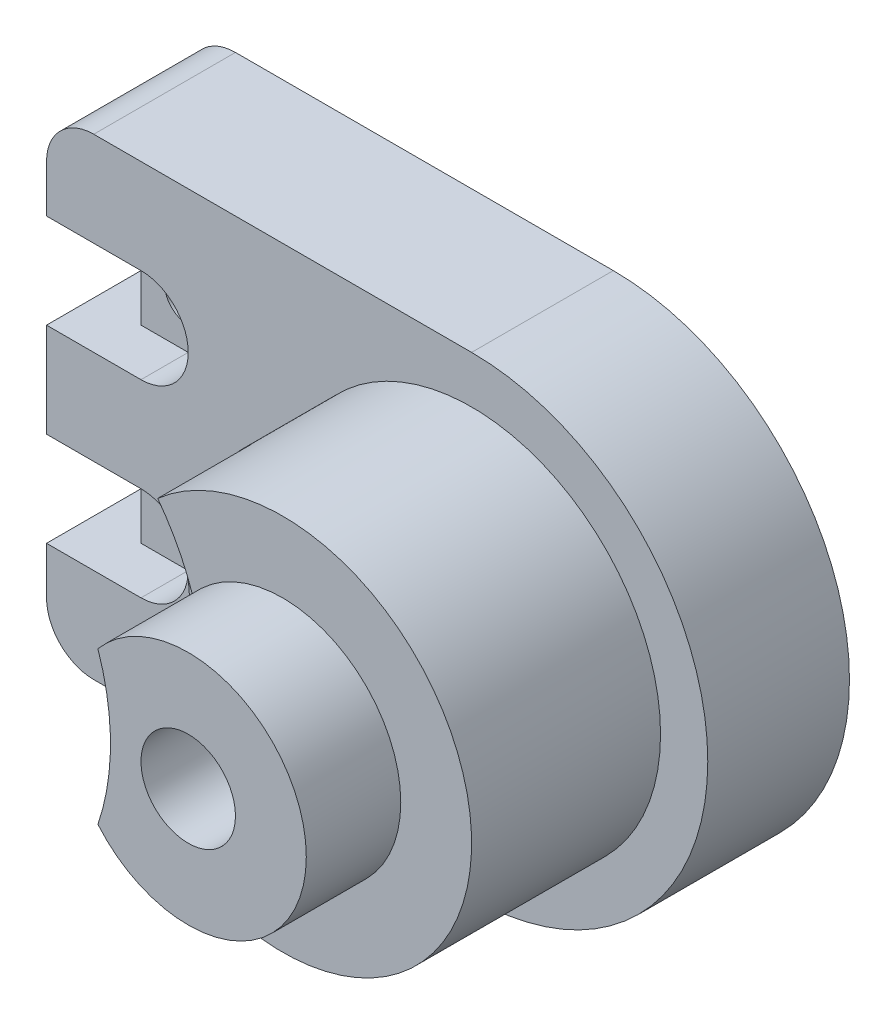
ISO-10303-21;
HEADER;
FILE_DESCRIPTION(('STEP AP214'),'2;1');
FILE_NAME('part.step','',(''),(''),'','','');
FILE_SCHEMA(('AUTOMOTIVE_DESIGN { 1 0 10303 214 1 1 1 1 }'));
ENDSEC;
DATA;
#1=APPLICATION_CONTEXT('core data for automotive mechanical design processes');
#2=APPLICATION_PROTOCOL_DEFINITION('international standard','automotive_design',2000,#1);
#3=PRODUCT_CONTEXT('',#1,'mechanical');
#4=PRODUCT('Part','Part','',(#3));
#5=PRODUCT_RELATED_PRODUCT_CATEGORY('part','',(#4));
#6=PRODUCT_DEFINITION_FORMATION('','',#4);
#7=PRODUCT_DEFINITION_CONTEXT('part definition',#1,'design');
#8=PRODUCT_DEFINITION('design','',#6,#7);
#9=PRODUCT_DEFINITION_SHAPE('','',#8);
#10=(LENGTH_UNIT() NAMED_UNIT(*) SI_UNIT(.MILLI.,.METRE.));
#11=(NAMED_UNIT(*) PLANE_ANGLE_UNIT() SI_UNIT($,.RADIAN.));
#12=(NAMED_UNIT(*) SI_UNIT($,.STERADIAN.) SOLID_ANGLE_UNIT());
#13=UNCERTAINTY_MEASURE_WITH_UNIT(LENGTH_MEASURE(1.E-05),#10,'distance_accuracy_value','');
#14=(GEOMETRIC_REPRESENTATION_CONTEXT(3) GLOBAL_UNCERTAINTY_ASSIGNED_CONTEXT((#13)) GLOBAL_UNIT_ASSIGNED_CONTEXT((#10,
#11,#12)) REPRESENTATION_CONTEXT('',''));
#15=CARTESIAN_POINT('',(0.,0.,0.));
#16=DIRECTION('',(0.,0.,1.));
#17=DIRECTION('',(1.,0.,0.));
#18=AXIS2_PLACEMENT_3D('',#15,#16,#17);
#19=CARTESIAN_POINT('',(0.,40.,0.));
#20=DIRECTION('',(0.,1.,0.));
#21=DIRECTION('',(0.,0.,1.));
#22=AXIS2_PLACEMENT_3D('',#19,#20,#21);
#23=PLANE('',#22);
#24=DIRECTION('',(-1.,0.,0.));
#25=VECTOR('',#24,1.);
#26=CARTESIAN_POINT('',(10.,40.,20.));
#27=LINE('',#26,#25);
#28=CARTESIAN_POINT('',(20.,40.,20.));
#29=VERTEX_POINT('',#28);
#30=CARTESIAN_POINT('',(10.,40.,20.));
#31=VERTEX_POINT('',#30);
#32=EDGE_CURVE('E259',#29,#31,#27,.T.);
#33=ORIENTED_EDGE('',*,*,#32,.F.);
#34=DIRECTION('',(0.,0.,1.));
#35=VECTOR('',#34,1.);
#36=CARTESIAN_POINT('',(20.,40.,-12.));
#37=LINE('',#36,#35);
#38=CARTESIAN_POINT('',(20.,40.,30.));
#39=VERTEX_POINT('',#38);
#40=EDGE_CURVE('E313',#29,#39,#37,.T.);
#41=ORIENTED_EDGE('',*,*,#40,.T.);
#42=DIRECTION('',(-1.,0.,0.));
#43=VECTOR('',#42,1.);
#44=CARTESIAN_POINT('',(0.,40.,30.));
#45=LINE('',#44,#43);
#46=CARTESIAN_POINT('',(0.,40.,30.));
#47=VERTEX_POINT('',#46);
#48=EDGE_CURVE('E346',#39,#47,#45,.T.);
#49=ORIENTED_EDGE('',*,*,#48,.T.);
#50=DIRECTION('',(0.,0.,1.));
#51=VECTOR('',#50,1.);
#52=CARTESIAN_POINT('',(0.,40.,0.));
#53=LINE('',#52,#51);
#54=CARTESIAN_POINT('',(0.,40.,0.));
#55=VERTEX_POINT('',#54);
#56=EDGE_CURVE('E353',#55,#47,#53,.T.);
#57=ORIENTED_EDGE('',*,*,#56,.F.);
#58=DIRECTION('',(-1.,0.,0.));
#59=VECTOR('',#58,1.);
#60=CARTESIAN_POINT('',(0.,40.,0.));
#61=LINE('',#60,#59);
#62=CARTESIAN_POINT('',(20.,40.,0.));
#63=VERTEX_POINT('',#62);
#64=EDGE_CURVE('E345',#63,#55,#61,.T.);
#65=ORIENTED_EDGE('',*,*,#64,.F.);
#66=CARTESIAN_POINT('',(20.,40.,10.));
#67=VERTEX_POINT('',#66);
#68=EDGE_CURVE('E318',#63,#67,#37,.T.);
#69=ORIENTED_EDGE('',*,*,#68,.T.);
#70=DIRECTION('',(-1.,0.,0.));
#71=VECTOR('',#70,1.);
#72=CARTESIAN_POINT('',(10.,40.,10.));
#73=LINE('',#72,#71);
#74=CARTESIAN_POINT('',(10.,40.,10.));
#75=VERTEX_POINT('',#74);
#76=EDGE_CURVE('E256',#67,#75,#73,.T.);
#77=ORIENTED_EDGE('',*,*,#76,.T.);
#78=DIRECTION('',(0.,0.,-1.));
#79=VECTOR('',#78,1.);
#80=CARTESIAN_POINT('',(10.,40.,20.));
#81=LINE('',#80,#79);
#82=EDGE_CURVE('E57',#31,#75,#81,.T.);
#83=ORIENTED_EDGE('',*,*,#82,.F.);
#84=EDGE_LOOP('',(#33,#41,#49,#57,#65,#69,#77,#83));
#85=FACE_BOUND('',#84,.T.);
#86=ADVANCED_FACE('F35',(#85),#23,.F.);
#87=CARTESIAN_POINT('',(0.,20.,0.));
#88=DIRECTION('',(0.,-1.,0.));
#89=DIRECTION('',(0.,0.,-1.));
#90=AXIS2_PLACEMENT_3D('',#87,#88,#89);
#91=PLANE('',#90);
#92=DIRECTION('',(1.,0.,0.));
#93=VECTOR('',#92,1.);
#94=CARTESIAN_POINT('',(10.,20.,20.));
#95=LINE('',#94,#93);
#96=CARTESIAN_POINT('',(10.,20.,20.));
#97=VERTEX_POINT('',#96);
#98=CARTESIAN_POINT('',(20.,20.,20.));
#99=VERTEX_POINT('',#98);
#100=EDGE_CURVE('E266',#97,#99,#95,.T.);
#101=ORIENTED_EDGE('',*,*,#100,.F.);
#102=DIRECTION('',(0.,0.,-1.));
#103=VECTOR('',#102,1.);
#104=CARTESIAN_POINT('',(10.,20.,20.));
#105=LINE('',#104,#103);
#106=CARTESIAN_POINT('',(10.,20.,10.));
#107=VERTEX_POINT('',#106);
#108=EDGE_CURVE('E272',#97,#107,#105,.T.);
#109=ORIENTED_EDGE('',*,*,#108,.T.);
#110=DIRECTION('',(1.,0.,0.));
#111=VECTOR('',#110,1.);
#112=CARTESIAN_POINT('',(10.,20.,10.));
#113=LINE('',#112,#111);
#114=CARTESIAN_POINT('',(20.,20.,10.));
#115=VERTEX_POINT('',#114);
#116=EDGE_CURVE('E277',#107,#115,#113,.T.);
#117=ORIENTED_EDGE('',*,*,#116,.T.);
#118=DIRECTION('',(0.,0.,1.));
#119=VECTOR('',#118,1.);
#120=CARTESIAN_POINT('',(20.,20.,-12.));
#121=LINE('',#120,#119);
#122=CARTESIAN_POINT('',(20.,20.,0.));
#123=VERTEX_POINT('',#122);
#124=EDGE_CURVE('E314',#123,#115,#121,.T.);
#125=ORIENTED_EDGE('',*,*,#124,.F.);
#126=DIRECTION('',(1.,0.,0.));
#127=VECTOR('',#126,1.);
#128=CARTESIAN_POINT('',(0.,20.,0.));
#129=LINE('',#128,#127);
#130=CARTESIAN_POINT('',(0.,20.,0.));
#131=VERTEX_POINT('',#130);
#132=EDGE_CURVE('E343',#131,#123,#129,.T.);
#133=ORIENTED_EDGE('',*,*,#132,.F.);
#134=DIRECTION('',(0.,0.,1.));
#135=VECTOR('',#134,1.);
#136=CARTESIAN_POINT('',(0.,20.,0.));
#137=LINE('',#136,#135);
#138=CARTESIAN_POINT('',(0.,20.,30.));
#139=VERTEX_POINT('',#138);
#140=EDGE_CURVE('E349',#131,#139,#137,.T.);
#141=ORIENTED_EDGE('',*,*,#140,.T.);
#142=DIRECTION('',(1.,0.,0.));
#143=VECTOR('',#142,1.);
#144=CARTESIAN_POINT('',(0.,20.,30.));
#145=LINE('',#144,#143);
#146=CARTESIAN_POINT('',(20.,20.,30.));
#147=VERTEX_POINT('',#146);
#148=EDGE_CURVE('E340',#139,#147,#145,.T.);
#149=ORIENTED_EDGE('',*,*,#148,.T.);
#150=EDGE_CURVE('E317',#99,#147,#121,.T.);
#151=ORIENTED_EDGE('',*,*,#150,.F.);
#152=EDGE_LOOP('',(#101,#109,#117,#125,#133,#141,#149,#151));
#153=FACE_BOUND('',#152,.T.);
#154=ADVANCED_FACE('F434',(#153),#91,.F.);
#155=CARTESIAN_POINT('',(20.,30.,-12.));
#156=DIRECTION('',(0.,0.,1.));
#157=DIRECTION('',(1.,0.,0.));
#158=AXIS2_PLACEMENT_3D('',#155,#156,#157);
#159=CYLINDRICAL_SURFACE('',#158,10.);
#160=ORIENTED_EDGE('',*,*,#40,.F.);
#161=CARTESIAN_POINT('',(20.,30.,20.));
#162=DIRECTION('',(0.,0.,1.));
#163=DIRECTION('',(-1.,0.,0.));
#164=AXIS2_PLACEMENT_3D('',#161,#162,#163);
#165=CIRCLE('',#164,10.);
#166=EDGE_CURVE('E269',#99,#29,#165,.T.);
#167=ORIENTED_EDGE('',*,*,#166,.F.);
#168=ORIENTED_EDGE('',*,*,#150,.T.);
#169=CARTESIAN_POINT('',(20.,30.,30.));
#170=DIRECTION('',(0.,0.,1.));
#171=DIRECTION('',(1.,0.,0.));
#172=AXIS2_PLACEMENT_3D('',#169,#170,#171);
#173=CIRCLE('',#172,10.);
#174=EDGE_CURVE('E310',#39,#147,#173,.F.);
#175=ORIENTED_EDGE('',*,*,#174,.F.);
#176=EDGE_LOOP('',(#160,#167,#168,#175));
#177=FACE_BOUND('',#176,.T.);
#178=ADVANCED_FACE('F493',(#177),#159,.F.);
#179=CARTESIAN_POINT('',(0.,80.,0.));
#180=DIRECTION('',(0.,1.,0.));
#181=DIRECTION('',(0.,0.,1.));
#182=AXIS2_PLACEMENT_3D('',#179,#180,#181);
#183=PLANE('',#182);
#184=DIRECTION('',(-1.,0.,0.));
#185=VECTOR('',#184,1.);
#186=CARTESIAN_POINT('',(10.,80.,20.));
#187=LINE('',#186,#185);
#188=CARTESIAN_POINT('',(20.,80.,20.));
#189=VERTEX_POINT('',#188);
#190=CARTESIAN_POINT('',(10.,80.,20.));
#191=VERTEX_POINT('',#190);
#192=EDGE_CURVE('E284',#189,#191,#187,.T.);
#193=ORIENTED_EDGE('',*,*,#192,.F.);
#194=DIRECTION('',(0.,0.,1.));
#195=VECTOR('',#194,1.);
#196=CARTESIAN_POINT('',(20.,80.,-12.));
#197=LINE('',#196,#195);
#198=CARTESIAN_POINT('',(20.,80.,30.));
#199=VERTEX_POINT('',#198);
#200=EDGE_CURVE('E323',#189,#199,#197,.T.);
#201=ORIENTED_EDGE('',*,*,#200,.T.);
#202=DIRECTION('',(-1.,0.,0.));
#203=VECTOR('',#202,1.);
#204=CARTESIAN_POINT('',(0.,80.,30.));
#205=LINE('',#204,#203);
#206=CARTESIAN_POINT('',(0.,80.,30.));
#207=VERTEX_POINT('',#206);
#208=EDGE_CURVE('E361',#199,#207,#205,.T.);
#209=ORIENTED_EDGE('',*,*,#208,.T.);
#210=DIRECTION('',(0.,0.,1.));
#211=VECTOR('',#210,1.);
#212=CARTESIAN_POINT('',(0.,80.,0.));
#213=LINE('',#212,#211);
#214=CARTESIAN_POINT('',(0.,80.,0.));
#215=VERTEX_POINT('',#214);
#216=EDGE_CURVE('E368',#215,#207,#213,.T.);
#217=ORIENTED_EDGE('',*,*,#216,.F.);
#218=DIRECTION('',(-1.,0.,0.));
#219=VECTOR('',#218,1.);
#220=CARTESIAN_POINT('',(0.,80.,0.));
#221=LINE('',#220,#219);
#222=CARTESIAN_POINT('',(20.,80.,0.));
#223=VERTEX_POINT('',#222);
#224=EDGE_CURVE('E360',#223,#215,#221,.T.);
#225=ORIENTED_EDGE('',*,*,#224,.F.);
#226=CARTESIAN_POINT('',(20.,80.,10.));
#227=VERTEX_POINT('',#226);
#228=EDGE_CURVE('E328',#223,#227,#197,.T.);
#229=ORIENTED_EDGE('',*,*,#228,.T.);
#230=DIRECTION('',(-1.,0.,0.));
#231=VECTOR('',#230,1.);
#232=CARTESIAN_POINT('',(10.,80.,10.));
#233=LINE('',#232,#231);
#234=CARTESIAN_POINT('',(10.,80.,10.));
#235=VERTEX_POINT('',#234);
#236=EDGE_CURVE('E283',#227,#235,#233,.T.);
#237=ORIENTED_EDGE('',*,*,#236,.T.);
#238=DIRECTION('',(0.,0.,-1.));
#239=VECTOR('',#238,1.);
#240=CARTESIAN_POINT('',(10.,80.,20.));
#241=LINE('',#240,#239);
#242=EDGE_CURVE('E307',#191,#235,#241,.T.);
#243=ORIENTED_EDGE('',*,*,#242,.F.);
#244=EDGE_LOOP('',(#193,#201,#209,#217,#225,#229,#237,#243));
#245=FACE_BOUND('',#244,.T.);
#246=ADVANCED_FACE('F491',(#245),#183,.F.);
#247=CARTESIAN_POINT('',(0.,60.,0.));
#248=DIRECTION('',(0.,-1.,0.));
#249=DIRECTION('',(1.,0.,0.));
#250=AXIS2_PLACEMENT_3D('',#247,#248,#249);
#251=PLANE('',#250);
#252=DIRECTION('',(1.,0.,0.));
#253=VECTOR('',#252,1.);
#254=CARTESIAN_POINT('',(10.,60.,20.));
#255=LINE('',#254,#253);
#256=CARTESIAN_POINT('',(10.,60.,20.));
#257=VERTEX_POINT('',#256);
#258=CARTESIAN_POINT('',(20.,60.,20.));
#259=VERTEX_POINT('',#258);
#260=EDGE_CURVE('E291',#257,#259,#255,.T.);
#261=ORIENTED_EDGE('',*,*,#260,.F.);
#262=DIRECTION('',(0.,0.,-1.));
#263=VECTOR('',#262,1.);
#264=CARTESIAN_POINT('',(10.,60.,20.));
#265=LINE('',#264,#263);
#266=CARTESIAN_POINT('',(10.,60.,10.));
#267=VERTEX_POINT('',#266);
#268=EDGE_CURVE('E297',#257,#267,#265,.T.);
#269=ORIENTED_EDGE('',*,*,#268,.T.);
#270=DIRECTION('',(1.,0.,0.));
#271=VECTOR('',#270,1.);
#272=CARTESIAN_POINT('',(10.,60.,10.));
#273=LINE('',#272,#271);
#274=CARTESIAN_POINT('',(20.,60.,10.));
#275=VERTEX_POINT('',#274);
#276=EDGE_CURVE('E302',#267,#275,#273,.T.);
#277=ORIENTED_EDGE('',*,*,#276,.T.);
#278=DIRECTION('',(0.,0.,1.));
#279=VECTOR('',#278,1.);
#280=CARTESIAN_POINT('',(20.,60.,-12.));
#281=LINE('',#280,#279);
#282=CARTESIAN_POINT('',(20.,60.,0.));
#283=VERTEX_POINT('',#282);
#284=EDGE_CURVE('E324',#283,#275,#281,.T.);
#285=ORIENTED_EDGE('',*,*,#284,.F.);
#286=DIRECTION('',(1.,0.,0.));
#287=VECTOR('',#286,1.);
#288=CARTESIAN_POINT('',(0.,60.,0.));
#289=LINE('',#288,#287);
#290=CARTESIAN_POINT('',(0.,60.,0.));
#291=VERTEX_POINT('',#290);
#292=EDGE_CURVE('E358',#291,#283,#289,.T.);
#293=ORIENTED_EDGE('',*,*,#292,.F.);
#294=DIRECTION('',(0.,0.,1.));
#295=VECTOR('',#294,1.);
#296=CARTESIAN_POINT('',(0.,60.,0.));
#297=LINE('',#296,#295);
#298=CARTESIAN_POINT('',(0.,60.,30.));
#299=VERTEX_POINT('',#298);
#300=EDGE_CURVE('E364',#291,#299,#297,.T.);
#301=ORIENTED_EDGE('',*,*,#300,.T.);
#302=DIRECTION('',(1.,0.,0.));
#303=VECTOR('',#302,1.);
#304=CARTESIAN_POINT('',(0.,60.,30.));
#305=LINE('',#304,#303);
#306=CARTESIAN_POINT('',(20.,60.,30.));
#307=VERTEX_POINT('',#306);
#308=EDGE_CURVE('E356',#299,#307,#305,.T.);
#309=ORIENTED_EDGE('',*,*,#308,.T.);
#310=EDGE_CURVE('E327',#259,#307,#281,.T.);
#311=ORIENTED_EDGE('',*,*,#310,.F.);
#312=EDGE_LOOP('',(#261,#269,#277,#285,#293,#301,#309,#311));
#313=FACE_BOUND('',#312,.T.);
#314=ADVANCED_FACE('F466',(#313),#251,.F.);
#315=CARTESIAN_POINT('',(20.,70.,-12.));
#316=DIRECTION('',(0.,0.,1.));
#317=DIRECTION('',(1.,0.,0.));
#318=AXIS2_PLACEMENT_3D('',#315,#316,#317);
#319=CYLINDRICAL_SURFACE('',#318,9.99999999999999);
#320=ORIENTED_EDGE('',*,*,#200,.F.);
#321=CARTESIAN_POINT('',(20.,70.,20.));
#322=DIRECTION('',(0.,0.,1.));
#323=DIRECTION('',(-1.,0.,0.));
#324=AXIS2_PLACEMENT_3D('',#321,#322,#323);
#325=CIRCLE('',#324,10.);
#326=EDGE_CURVE('E294',#259,#189,#325,.T.);
#327=ORIENTED_EDGE('',*,*,#326,.F.);
#328=ORIENTED_EDGE('',*,*,#310,.T.);
#329=CARTESIAN_POINT('',(20.,70.,30.));
#330=DIRECTION('',(0.,0.,1.));
#331=DIRECTION('',(1.,0.,0.));
#332=AXIS2_PLACEMENT_3D('',#329,#330,#331);
#333=CIRCLE('',#332,9.99999999999999);
#334=EDGE_CURVE('E316',#199,#307,#333,.F.);
#335=ORIENTED_EDGE('',*,*,#334,.F.);
#336=EDGE_LOOP('',(#320,#327,#328,#335));
#337=FACE_BOUND('',#336,.T.);
#338=ADVANCED_FACE('F474',(#337),#319,.F.);
#339=CARTESIAN_POINT('',(90.,50.,70.));
#340=DIRECTION('',(0.,0.,1.));
#341=DIRECTION('',(1.,0.,0.));
#342=AXIS2_PLACEMENT_3D('',#339,#340,#341);
#343=PLANE('',#342);
#344=CARTESIAN_POINT('',(23.542486889354,50.,70.));
#345=DIRECTION('',(0.,0.,1.));
#346=DIRECTION('',(1.,0.,0.));
#347=AXIS2_PLACEMENT_3D('',#344,#345,#346);
#348=CIRCLE('',#347,50.);
#349=CARTESIAN_POINT('',(70.8780006210875,66.1043205306176,70.));
#350=VERTEX_POINT('',#349);
#351=CARTESIAN_POINT('',(63.5424868893541,80.,70.));
#352=VERTEX_POINT('',#351);
#353=EDGE_CURVE('E243',#350,#352,#348,.T.);
#354=ORIENTED_EDGE('',*,*,#353,.F.);
#355=CARTESIAN_POINT('',(90.,50.,70.));
#356=DIRECTION('',(0.,0.,1.));
#357=DIRECTION('',(1.,0.,0.));
#358=AXIS2_PLACEMENT_3D('',#355,#356,#357);
#359=CIRCLE('',#358,25.);
#360=CARTESIAN_POINT('',(70.8780006210876,33.8956794693824,70.));
#361=VERTEX_POINT('',#360);
#362=EDGE_CURVE('E326',#361,#350,#359,.T.);
#363=ORIENTED_EDGE('',*,*,#362,.F.);
#364=CARTESIAN_POINT('',(63.5424868893541,20.,70.));
#365=VERTEX_POINT('',#364);
#366=EDGE_CURVE('E240',#365,#361,#348,.T.);
#367=ORIENTED_EDGE('',*,*,#366,.F.);
#368=CARTESIAN_POINT('',(90.,50.,70.));
#369=DIRECTION('',(0.,0.,1.));
#370=DIRECTION('',(1.,0.,0.));
#371=AXIS2_PLACEMENT_3D('',#368,#369,#370);
#372=CIRCLE('',#371,40.);
#373=EDGE_CURVE('E337',#365,#352,#372,.T.);
#374=ORIENTED_EDGE('',*,*,#373,.T.);
#375=EDGE_LOOP('',(#354,#363,#367,#374));
#376=FACE_BOUND('',#375,.T.);
#377=ADVANCED_FACE('F515',(#376),#343,.T.);
#378=CARTESIAN_POINT('',(0.,0.,30.));
#379=DIRECTION('',(0.,0.,1.));
#380=DIRECTION('',(1.,0.,0.));
#381=AXIS2_PLACEMENT_3D('',#378,#379,#380);
#382=PLANE('',#381);
#383=ORIENTED_EDGE('',*,*,#174,.T.);
#384=ORIENTED_EDGE('',*,*,#148,.F.);
#385=DIRECTION('',(0.,1.,0.));
#386=VECTOR('',#385,1.);
#387=CARTESIAN_POINT('',(0.,0.,30.));
#388=LINE('',#387,#386);
#389=CARTESIAN_POINT('',(0.,10.,30.));
#390=VERTEX_POINT('',#389);
#391=EDGE_CURVE('E402',#390,#139,#388,.T.);
#392=ORIENTED_EDGE('',*,*,#391,.F.);
#393=CARTESIAN_POINT('',(10.,10.,30.));
#394=DIRECTION('',(0.,0.,-1.));
#395=DIRECTION('',(1.,0.,0.));
#396=AXIS2_PLACEMENT_3D('',#393,#394,#395);
#397=CIRCLE('',#396,10.);
#398=CARTESIAN_POINT('',(10.,0.,30.));
#399=VERTEX_POINT('',#398);
#400=EDGE_CURVE('E371',#399,#390,#397,.T.);
#401=ORIENTED_EDGE('',*,*,#400,.F.);
#402=DIRECTION('',(1.,0.,0.));
#403=VECTOR('',#402,1.);
#404=CARTESIAN_POINT('',(0.,0.,30.));
#405=LINE('',#404,#403);
#406=CARTESIAN_POINT('',(90.,0.,30.));
#407=VERTEX_POINT('',#406);
#408=EDGE_CURVE('E405',#399,#407,#405,.T.);
#409=ORIENTED_EDGE('',*,*,#408,.T.);
#410=CARTESIAN_POINT('',(90.,50.,30.));
#411=DIRECTION('',(0.,0.,1.));
#412=DIRECTION('',(1.,0.,0.));
#413=AXIS2_PLACEMENT_3D('',#410,#411,#412);
#414=CIRCLE('',#413,50.);
#415=CARTESIAN_POINT('',(90.,100.,30.));
#416=VERTEX_POINT('',#415);
#417=EDGE_CURVE('E395',#416,#407,#414,.F.);
#418=ORIENTED_EDGE('',*,*,#417,.F.);
#419=DIRECTION('',(1.,0.,0.));
#420=VECTOR('',#419,1.);
#421=CARTESIAN_POINT('',(0.,100.,30.));
#422=LINE('',#421,#420);
#423=CARTESIAN_POINT('',(10.,100.,30.));
#424=VERTEX_POINT('',#423);
#425=EDGE_CURVE('E398',#424,#416,#422,.T.);
#426=ORIENTED_EDGE('',*,*,#425,.F.);
#427=CARTESIAN_POINT('',(10.,90.,30.));
#428=DIRECTION('',(0.,0.,-1.));
#429=DIRECTION('',(-1.,0.,0.));
#430=AXIS2_PLACEMENT_3D('',#427,#428,#429);
#431=CIRCLE('',#430,10.);
#432=CARTESIAN_POINT('',(0.,90.,30.));
#433=VERTEX_POINT('',#432);
#434=EDGE_CURVE('E381',#433,#424,#431,.T.);
#435=ORIENTED_EDGE('',*,*,#434,.F.);
#436=EDGE_CURVE('E401',#207,#433,#388,.T.);
#437=ORIENTED_EDGE('',*,*,#436,.F.);
#438=ORIENTED_EDGE('',*,*,#208,.F.);
#439=ORIENTED_EDGE('',*,*,#334,.T.);
#440=ORIENTED_EDGE('',*,*,#308,.F.);
#441=EDGE_CURVE('E406',#47,#299,#388,.T.);
#442=ORIENTED_EDGE('',*,*,#441,.F.);
#443=ORIENTED_EDGE('',*,*,#48,.F.);
#444=EDGE_LOOP('',(#383,#384,#392,#401,#409,#418,#426,#435,#437,#438,#439,#440,#442,#443));
#445=FACE_BOUND('',#444,.T.);
#446=CARTESIAN_POINT('',(90.,50.,30.));
#447=DIRECTION('',(0.,0.,1.));
#448=DIRECTION('',(1.,0.,0.));
#449=AXIS2_PLACEMENT_3D('',#446,#447,#448);
#450=CIRCLE('',#449,40.);
#451=CARTESIAN_POINT('',(130.,50.,30.));
#452=VERTEX_POINT('',#451);
#453=EDGE_CURVE('E334',#452,#452,#450,.T.);
#454=ORIENTED_EDGE('',*,*,#453,.F.);
#455=EDGE_LOOP('',(#454));
#456=FACE_BOUND('',#455,.T.);
#457=ADVANCED_FACE('F469',(#445,#456),#382,.T.);
#458=CARTESIAN_POINT('',(0.,0.,30.));
#459=DIRECTION('',(-1.,0.,0.));
#460=DIRECTION('',(0.,0.,1.));
#461=AXIS2_PLACEMENT_3D('',#458,#459,#460);
#462=PLANE('',#461);
#463=ORIENTED_EDGE('',*,*,#56,.T.);
#464=ORIENTED_EDGE('',*,*,#441,.T.);
#465=ORIENTED_EDGE('',*,*,#300,.F.);
#466=DIRECTION('',(0.,1.,0.));
#467=VECTOR('',#466,1.);
#468=CARTESIAN_POINT('',(0.,0.,0.));
#469=LINE('',#468,#467);
#470=EDGE_CURVE('E417',#55,#291,#469,.T.);
#471=ORIENTED_EDGE('',*,*,#470,.F.);
#472=EDGE_LOOP('',(#463,#464,#465,#471));
#473=FACE_BOUND('',#472,.T.);
#474=ADVANCED_FACE('F448',(#473),#462,.T.);
#475=ORIENTED_EDGE('',*,*,#216,.T.);
#476=ORIENTED_EDGE('',*,*,#436,.T.);
#477=DIRECTION('',(0.,0.,1.));
#478=VECTOR('',#477,1.);
#479=CARTESIAN_POINT('',(0.,90.,0.));
#480=LINE('',#479,#478);
#481=CARTESIAN_POINT('',(0.,90.,0.));
#482=VERTEX_POINT('',#481);
#483=EDGE_CURVE('E389',#482,#433,#480,.T.);
#484=ORIENTED_EDGE('',*,*,#483,.F.);
#485=EDGE_CURVE('E413',#215,#482,#469,.T.);
#486=ORIENTED_EDGE('',*,*,#485,.F.);
#487=EDGE_LOOP('',(#475,#476,#484,#486));
#488=FACE_BOUND('',#487,.T.);
#489=ADVANCED_FACE('F459',(#488),#462,.T.);
#490=ORIENTED_EDGE('',*,*,#140,.F.);
#491=CARTESIAN_POINT('',(0.,10.,0.));
#492=VERTEX_POINT('',#491);
#493=EDGE_CURVE('E414',#492,#131,#469,.T.);
#494=ORIENTED_EDGE('',*,*,#493,.F.);
#495=DIRECTION('',(0.,0.,1.));
#496=VECTOR('',#495,1.);
#497=CARTESIAN_POINT('',(0.,10.,0.));
#498=LINE('',#497,#496);
#499=EDGE_CURVE('E377',#492,#390,#498,.T.);
#500=ORIENTED_EDGE('',*,*,#499,.T.);
#501=ORIENTED_EDGE('',*,*,#391,.T.);
#502=EDGE_LOOP('',(#490,#494,#500,#501));
#503=FACE_BOUND('',#502,.T.);
#504=ADVANCED_FACE('F589',(#503),#462,.T.);
#505=CARTESIAN_POINT('',(90.,50.,30.));
#506=DIRECTION('',(0.,0.,-1.));
#507=DIRECTION('',(-1.,0.,0.));
#508=AXIS2_PLACEMENT_3D('',#505,#506,#507);
#509=CYLINDRICAL_SURFACE('',#508,50.);
#510=CARTESIAN_POINT('',(90.,50.,0.));
#511=DIRECTION('',(0.,0.,1.));
#512=DIRECTION('',(1.,0.,0.));
#513=AXIS2_PLACEMENT_3D('',#510,#511,#512);
#514=CIRCLE('',#513,50.);
#515=CARTESIAN_POINT('',(90.,100.,0.));
#516=VERTEX_POINT('',#515);
#517=CARTESIAN_POINT('',(90.,0.,0.));
#518=VERTEX_POINT('',#517);
#519=EDGE_CURVE('E392',#516,#518,#514,.F.);
#520=ORIENTED_EDGE('',*,*,#519,.F.);
#521=DIRECTION('',(0.,0.,-1.));
#522=VECTOR('',#521,1.);
#523=CARTESIAN_POINT('',(90.,100.,30.));
#524=LINE('',#523,#522);
#525=EDGE_CURVE('E421',#416,#516,#524,.T.);
#526=ORIENTED_EDGE('',*,*,#525,.F.);
#527=ORIENTED_EDGE('',*,*,#417,.T.);
#528=DIRECTION('',(0.,0.,-1.));
#529=VECTOR('',#528,1.);
#530=CARTESIAN_POINT('',(90.,0.,30.));
#531=LINE('',#530,#529);
#532=EDGE_CURVE('E408',#407,#518,#531,.T.);
#533=ORIENTED_EDGE('',*,*,#532,.T.);
#534=EDGE_LOOP('',(#520,#526,#527,#533));
#535=FACE_BOUND('',#534,.T.);
#536=ADVANCED_FACE('F37',(#535),#509,.T.);
#537=CARTESIAN_POINT('',(0.,100.,30.));
#538=DIRECTION('',(0.,1.,0.));
#539=DIRECTION('',(0.,0.,1.));
#540=AXIS2_PLACEMENT_3D('',#537,#538,#539);
#541=PLANE('',#540);
#542=DIRECTION('',(0.,0.,1.));
#543=VECTOR('',#542,1.);
#544=CARTESIAN_POINT('',(10.,100.,0.));
#545=LINE('',#544,#543);
#546=CARTESIAN_POINT('',(10.,100.,0.));
#547=VERTEX_POINT('',#546);
#548=EDGE_CURVE('E387',#547,#424,#545,.T.);
#549=ORIENTED_EDGE('',*,*,#548,.T.);
#550=ORIENTED_EDGE('',*,*,#425,.T.);
#551=ORIENTED_EDGE('',*,*,#525,.T.);
#552=DIRECTION('',(1.,0.,0.));
#553=VECTOR('',#552,1.);
#554=CARTESIAN_POINT('',(0.,100.,0.));
#555=LINE('',#554,#553);
#556=EDGE_CURVE('E411',#547,#516,#555,.T.);
#557=ORIENTED_EDGE('',*,*,#556,.F.);
#558=EDGE_LOOP('',(#549,#550,#551,#557));
#559=FACE_BOUND('',#558,.T.);
#560=ADVANCED_FACE('F598',(#559),#541,.T.);
#561=CARTESIAN_POINT('',(0.,0.,30.));
#562=DIRECTION('',(0.,1.,0.));
#563=DIRECTION('',(0.,0.,1.));
#564=AXIS2_PLACEMENT_3D('',#561,#562,#563);
#565=PLANE('',#564);
#566=ORIENTED_EDGE('',*,*,#408,.F.);
#567=DIRECTION('',(0.,0.,1.));
#568=VECTOR('',#567,1.);
#569=CARTESIAN_POINT('',(10.,0.,0.));
#570=LINE('',#569,#568);
#571=CARTESIAN_POINT('',(10.,0.,0.));
#572=VERTEX_POINT('',#571);
#573=EDGE_CURVE('E379',#572,#399,#570,.T.);
#574=ORIENTED_EDGE('',*,*,#573,.F.);
#575=DIRECTION('',(1.,0.,0.));
#576=VECTOR('',#575,1.);
#577=CARTESIAN_POINT('',(0.,0.,0.));
#578=LINE('',#577,#576);
#579=EDGE_CURVE('E399',#572,#518,#578,.T.);
#580=ORIENTED_EDGE('',*,*,#579,.T.);
#581=ORIENTED_EDGE('',*,*,#532,.F.);
#582=EDGE_LOOP('',(#566,#574,#580,#581));
#583=FACE_BOUND('',#582,.T.);
#584=ADVANCED_FACE('F595',(#583),#565,.F.);
#585=CARTESIAN_POINT('',(0.,0.,0.));
#586=DIRECTION('',(0.,0.,1.));
#587=DIRECTION('',(1.,0.,0.));
#588=AXIS2_PLACEMENT_3D('',#585,#586,#587);
#589=PLANE('',#588);
#590=CARTESIAN_POINT('',(60.,50.,0.));
#591=DIRECTION('',(0.,0.,1.));
#592=DIRECTION('',(1.,0.,0.));
#593=AXIS2_PLACEMENT_3D('',#590,#591,#592);
#594=CIRCLE('',#593,5.00000000000001);
#595=CARTESIAN_POINT('',(65.,50.,0.));
#596=VERTEX_POINT('',#595);
#597=EDGE_CURVE('E222',#596,#596,#594,.T.);
#598=ORIENTED_EDGE('',*,*,#597,.T.);
#599=EDGE_LOOP('',(#598));
#600=FACE_BOUND('',#599,.T.);
#601=ORIENTED_EDGE('',*,*,#132,.T.);
#602=CARTESIAN_POINT('',(20.,30.,0.));
#603=DIRECTION('',(0.,0.,1.));
#604=DIRECTION('',(1.,0.,0.));
#605=AXIS2_PLACEMENT_3D('',#602,#603,#604);
#606=CIRCLE('',#605,10.);
#607=EDGE_CURVE('E43',#63,#123,#606,.F.);
#608=ORIENTED_EDGE('',*,*,#607,.F.);
#609=ORIENTED_EDGE('',*,*,#64,.T.);
#610=ORIENTED_EDGE('',*,*,#470,.T.);
#611=ORIENTED_EDGE('',*,*,#292,.T.);
#612=CARTESIAN_POINT('',(20.,70.,0.));
#613=DIRECTION('',(0.,0.,1.));
#614=DIRECTION('',(1.,0.,0.));
#615=AXIS2_PLACEMENT_3D('',#612,#613,#614);
#616=CIRCLE('',#615,9.99999999999999);
#617=EDGE_CURVE('E424',#223,#283,#616,.F.);
#618=ORIENTED_EDGE('',*,*,#617,.F.);
#619=ORIENTED_EDGE('',*,*,#224,.T.);
#620=ORIENTED_EDGE('',*,*,#485,.T.);
#621=CARTESIAN_POINT('',(10.,90.,0.));
#622=DIRECTION('',(0.,0.,-1.));
#623=DIRECTION('',(-1.,0.,0.));
#624=AXIS2_PLACEMENT_3D('',#621,#622,#623);
#625=CIRCLE('',#624,10.);
#626=EDGE_CURVE('E384',#482,#547,#625,.T.);
#627=ORIENTED_EDGE('',*,*,#626,.T.);
#628=ORIENTED_EDGE('',*,*,#556,.T.);
#629=ORIENTED_EDGE('',*,*,#519,.T.);
#630=ORIENTED_EDGE('',*,*,#579,.F.);
#631=CARTESIAN_POINT('',(10.,10.,0.));
#632=DIRECTION('',(0.,0.,-1.));
#633=DIRECTION('',(1.,0.,0.));
#634=AXIS2_PLACEMENT_3D('',#631,#632,#633);
#635=CIRCLE('',#634,10.);
#636=EDGE_CURVE('E374',#572,#492,#635,.T.);
#637=ORIENTED_EDGE('',*,*,#636,.T.);
#638=ORIENTED_EDGE('',*,*,#493,.T.);
#639=EDGE_LOOP('',(#601,#608,#609,#610,#611,#618,#619,#620,#627,#628,#629,#630,#637,#638));
#640=FACE_BOUND('',#639,.T.);
#641=ADVANCED_FACE('F444',(#600,#640),#589,.F.);
#642=CARTESIAN_POINT('',(10.,90.,0.));
#643=DIRECTION('',(0.,0.,1.));
#644=DIRECTION('',(1.,0.,0.));
#645=AXIS2_PLACEMENT_3D('',#642,#643,#644);
#646=CYLINDRICAL_SURFACE('',#645,10.);
#647=ORIENTED_EDGE('',*,*,#434,.T.);
#648=ORIENTED_EDGE('',*,*,#548,.F.);
#649=ORIENTED_EDGE('',*,*,#626,.F.);
#650=ORIENTED_EDGE('',*,*,#483,.T.);
#651=EDGE_LOOP('',(#647,#648,#649,#650));
#652=FACE_BOUND('',#651,.T.);
#653=ADVANCED_FACE('F457',(#652),#646,.T.);
#654=CARTESIAN_POINT('',(10.,10.,0.));
#655=DIRECTION('',(0.,0.,1.));
#656=DIRECTION('',(1.,0.,0.));
#657=AXIS2_PLACEMENT_3D('',#654,#655,#656);
#658=CYLINDRICAL_SURFACE('',#657,10.);
#659=ORIENTED_EDGE('',*,*,#400,.T.);
#660=ORIENTED_EDGE('',*,*,#499,.F.);
#661=ORIENTED_EDGE('',*,*,#636,.F.);
#662=ORIENTED_EDGE('',*,*,#573,.T.);
#663=EDGE_LOOP('',(#659,#660,#661,#662));
#664=FACE_BOUND('',#663,.T.);
#665=ADVANCED_FACE('F513',(#664),#658,.T.);
#666=CARTESIAN_POINT('',(90.,50.,70.));
#667=DIRECTION('',(0.,0.,-1.));
#668=DIRECTION('',(-1.,0.,0.));
#669=AXIS2_PLACEMENT_3D('',#666,#667,#668);
#670=CYLINDRICAL_SURFACE('',#669,40.);
#671=CARTESIAN_POINT('',(90.,50.,50.));
#672=DIRECTION('',(0.,0.,1.));
#673=DIRECTION('',(1.,0.,0.));
#674=AXIS2_PLACEMENT_3D('',#671,#672,#673);
#675=CIRCLE('',#674,40.);
#676=CARTESIAN_POINT('',(63.5424868893541,80.,50.));
#677=VERTEX_POINT('',#676);
#678=CARTESIAN_POINT('',(63.5424868893541,20.,50.));
#679=VERTEX_POINT('',#678);
#680=EDGE_CURVE('E228',#677,#679,#675,.T.);
#681=ORIENTED_EDGE('',*,*,#680,.F.);
#682=DIRECTION('',(0.,0.,-1.));
#683=VECTOR('',#682,1.);
#684=CARTESIAN_POINT('',(63.5424868893541,80.,90.));
#685=LINE('',#684,#683);
#686=EDGE_CURVE('E234',#352,#677,#685,.T.);
#687=ORIENTED_EDGE('',*,*,#686,.F.);
#688=ORIENTED_EDGE('',*,*,#373,.F.);
#689=DIRECTION('',(0.,0.,-1.));
#690=VECTOR('',#689,1.);
#691=CARTESIAN_POINT('',(63.5424868893541,20.,90.));
#692=LINE('',#691,#690);
#693=EDGE_CURVE('E236',#365,#679,#692,.T.);
#694=ORIENTED_EDGE('',*,*,#693,.T.);
#695=EDGE_LOOP('',(#681,#687,#688,#694));
#696=FACE_BOUND('',#695,.T.);
#697=ORIENTED_EDGE('',*,*,#453,.T.);
#698=EDGE_LOOP('',(#697));
#699=FACE_BOUND('',#698,.T.);
#700=ADVANCED_FACE('F509',(#696,#699),#670,.T.);
#701=CARTESIAN_POINT('',(90.,50.,90.));
#702=DIRECTION('',(0.,0.,-1.));
#703=DIRECTION('',(-1.,0.,0.));
#704=AXIS2_PLACEMENT_3D('',#701,#702,#703);
#705=CYLINDRICAL_SURFACE('',#704,25.);
#706=ORIENTED_EDGE('',*,*,#362,.T.);
#707=DIRECTION('',(0.,0.,-1.));
#708=VECTOR('',#707,1.);
#709=CARTESIAN_POINT('',(70.8780006210875,66.1043205306176,70.));
#710=LINE('',#709,#708);
#711=CARTESIAN_POINT('',(70.8780006210875,66.1043205306176,90.));
#712=VERTEX_POINT('',#711);
#713=EDGE_CURVE('E242',#350,#712,#710,.F.);
#714=ORIENTED_EDGE('',*,*,#713,.T.);
#715=CARTESIAN_POINT('',(90.,50.,90.));
#716=DIRECTION('',(0.,0.,1.));
#717=DIRECTION('',(1.,0.,0.));
#718=AXIS2_PLACEMENT_3D('',#715,#716,#717);
#719=CIRCLE('',#718,25.);
#720=CARTESIAN_POINT('',(70.8780006210875,33.8956794693824,90.));
#721=VERTEX_POINT('',#720);
#722=EDGE_CURVE('E331',#721,#712,#719,.T.);
#723=ORIENTED_EDGE('',*,*,#722,.F.);
#724=DIRECTION('',(0.,0.,-1.));
#725=VECTOR('',#724,1.);
#726=CARTESIAN_POINT('',(70.8780006210876,33.8956794693824,70.));
#727=LINE('',#726,#725);
#728=EDGE_CURVE('E49',#721,#361,#727,.T.);
#729=ORIENTED_EDGE('',*,*,#728,.T.);
#730=EDGE_LOOP('',(#706,#714,#723,#729));
#731=FACE_BOUND('',#730,.T.);
#732=ADVANCED_FACE('F512',(#731),#705,.T.);
#733=CARTESIAN_POINT('',(90.,50.,90.));
#734=DIRECTION('',(0.,0.,1.));
#735=DIRECTION('',(1.,0.,0.));
#736=AXIS2_PLACEMENT_3D('',#733,#734,#735);
#737=PLANE('',#736);
#738=CARTESIAN_POINT('',(90.,50.,90.));
#739=DIRECTION('',(0.,0.,1.));
#740=DIRECTION('',(1.,0.,0.));
#741=AXIS2_PLACEMENT_3D('',#738,#739,#740);
#742=CIRCLE('',#741,9.99999999999998);
#743=CARTESIAN_POINT('',(100.,50.,90.));
#744=VERTEX_POINT('',#743);
#745=EDGE_CURVE('E219',#744,#744,#742,.T.);
#746=ORIENTED_EDGE('',*,*,#745,.F.);
#747=EDGE_LOOP('',(#746));
#748=FACE_BOUND('',#747,.T.);
#749=CARTESIAN_POINT('',(23.542486889354,50.,90.));
#750=DIRECTION('',(0.,0.,1.));
#751=DIRECTION('',(1.,0.,0.));
#752=AXIS2_PLACEMENT_3D('',#749,#750,#751);
#753=CIRCLE('',#752,50.);
#754=EDGE_CURVE('E11',#721,#712,#753,.T.);
#755=ORIENTED_EDGE('',*,*,#754,.F.);
#756=ORIENTED_EDGE('',*,*,#722,.T.);
#757=EDGE_LOOP('',(#755,#756));
#758=FACE_BOUND('',#757,.T.);
#759=ADVANCED_FACE('F521',(#748,#758),#737,.T.);
#760=CARTESIAN_POINT('',(20.,70.,10.));
#761=DIRECTION('',(0.,0.,1.));
#762=DIRECTION('',(-1.,0.,0.));
#763=AXIS2_PLACEMENT_3D('',#760,#761,#762);
#764=CIRCLE('',#763,10.);
#765=EDGE_CURVE('E288',#275,#227,#764,.T.);
#766=ORIENTED_EDGE('',*,*,#765,.T.);
#767=ORIENTED_EDGE('',*,*,#228,.F.);
#768=ORIENTED_EDGE('',*,*,#617,.T.);
#769=ORIENTED_EDGE('',*,*,#284,.T.);
#770=EDGE_LOOP('',(#766,#767,#768,#769));
#771=FACE_BOUND('',#770,.T.);
#772=ADVANCED_FACE('F489',(#771),#319,.F.);
#773=CARTESIAN_POINT('',(20.,30.,10.));
#774=DIRECTION('',(0.,0.,1.));
#775=DIRECTION('',(-1.,0.,0.));
#776=AXIS2_PLACEMENT_3D('',#773,#774,#775);
#777=CIRCLE('',#776,10.);
#778=EDGE_CURVE('E263',#115,#67,#777,.T.);
#779=ORIENTED_EDGE('',*,*,#778,.T.);
#780=ORIENTED_EDGE('',*,*,#68,.F.);
#781=ORIENTED_EDGE('',*,*,#607,.T.);
#782=ORIENTED_EDGE('',*,*,#124,.T.);
#783=EDGE_LOOP('',(#779,#780,#781,#782));
#784=FACE_BOUND('',#783,.T.);
#785=ADVANCED_FACE('F431',(#784),#159,.F.);
#786=CARTESIAN_POINT('',(10.,80.,20.));
#787=DIRECTION('',(1.,0.,0.));
#788=DIRECTION('',(0.,1.,0.));
#789=AXIS2_PLACEMENT_3D('',#786,#787,#788);
#790=PLANE('',#789);
#791=DIRECTION('',(0.,-1.,0.));
#792=VECTOR('',#791,1.);
#793=CARTESIAN_POINT('',(10.,80.,10.));
#794=LINE('',#793,#792);
#795=EDGE_CURVE('E299',#235,#267,#794,.T.);
#796=ORIENTED_EDGE('',*,*,#795,.T.);
#797=ORIENTED_EDGE('',*,*,#268,.F.);
#798=DIRECTION('',(0.,-1.,0.));
#799=VECTOR('',#798,1.);
#800=CARTESIAN_POINT('',(10.,80.,20.));
#801=LINE('',#800,#799);
#802=EDGE_CURVE('E287',#191,#257,#801,.T.);
#803=ORIENTED_EDGE('',*,*,#802,.F.);
#804=ORIENTED_EDGE('',*,*,#242,.T.);
#805=EDGE_LOOP('',(#796,#797,#803,#804));
#806=FACE_BOUND('',#805,.T.);
#807=ADVANCED_FACE('F480',(#806),#790,.F.);
#808=CARTESIAN_POINT('',(20.,70.,20.));
#809=DIRECTION('',(0.,0.,-1.));
#810=DIRECTION('',(-1.,0.,0.));
#811=AXIS2_PLACEMENT_3D('',#808,#809,#810);
#812=PLANE('',#811);
#813=CARTESIAN_POINT('',(20.,70.,20.));
#814=DIRECTION('',(0.,0.,1.));
#815=DIRECTION('',(1.,0.,0.));
#816=AXIS2_PLACEMENT_3D('',#813,#814,#815);
#817=CIRCLE('',#816,5.);
#818=CARTESIAN_POINT('',(25.,70.,20.));
#819=VERTEX_POINT('',#818);
#820=EDGE_CURVE('E249',#819,#819,#817,.T.);
#821=ORIENTED_EDGE('',*,*,#820,.F.);
#822=EDGE_LOOP('',(#821));
#823=FACE_BOUND('',#822,.T.);
#824=ORIENTED_EDGE('',*,*,#192,.T.);
#825=ORIENTED_EDGE('',*,*,#802,.T.);
#826=ORIENTED_EDGE('',*,*,#260,.T.);
#827=ORIENTED_EDGE('',*,*,#326,.T.);
#828=EDGE_LOOP('',(#824,#825,#826,#827));
#829=FACE_BOUND('',#828,.T.);
#830=ADVANCED_FACE('F476',(#823,#829),#812,.F.);
#831=CARTESIAN_POINT('',(20.,70.,10.));
#832=DIRECTION('',(0.,0.,-1.));
#833=DIRECTION('',(-1.,0.,0.));
#834=AXIS2_PLACEMENT_3D('',#831,#832,#833);
#835=PLANE('',#834);
#836=CARTESIAN_POINT('',(20.,70.,10.));
#837=DIRECTION('',(0.,0.,1.));
#838=DIRECTION('',(1.,0.,0.));
#839=AXIS2_PLACEMENT_3D('',#836,#837,#838);
#840=CIRCLE('',#839,5.);
#841=CARTESIAN_POINT('',(25.,70.,10.));
#842=VERTEX_POINT('',#841);
#843=EDGE_CURVE('E253',#842,#842,#840,.T.);
#844=ORIENTED_EDGE('',*,*,#843,.T.);
#845=EDGE_LOOP('',(#844));
#846=FACE_BOUND('',#845,.T.);
#847=ORIENTED_EDGE('',*,*,#236,.F.);
#848=ORIENTED_EDGE('',*,*,#765,.F.);
#849=ORIENTED_EDGE('',*,*,#276,.F.);
#850=ORIENTED_EDGE('',*,*,#795,.F.);
#851=EDGE_LOOP('',(#847,#848,#849,#850));
#852=FACE_BOUND('',#851,.T.);
#853=ADVANCED_FACE('F486',(#846,#852),#835,.T.);
#854=CARTESIAN_POINT('',(10.,40.,20.));
#855=DIRECTION('',(1.,0.,0.));
#856=DIRECTION('',(0.,1.,0.));
#857=AXIS2_PLACEMENT_3D('',#854,#855,#856);
#858=PLANE('',#857);
#859=DIRECTION('',(0.,-1.,0.));
#860=VECTOR('',#859,1.);
#861=CARTESIAN_POINT('',(10.,40.,10.));
#862=LINE('',#861,#860);
#863=EDGE_CURVE('E274',#75,#107,#862,.T.);
#864=ORIENTED_EDGE('',*,*,#863,.T.);
#865=ORIENTED_EDGE('',*,*,#108,.F.);
#866=DIRECTION('',(0.,-1.,0.));
#867=VECTOR('',#866,1.);
#868=CARTESIAN_POINT('',(10.,40.,20.));
#869=LINE('',#868,#867);
#870=EDGE_CURVE('E262',#31,#97,#869,.T.);
#871=ORIENTED_EDGE('',*,*,#870,.F.);
#872=ORIENTED_EDGE('',*,*,#82,.T.);
#873=EDGE_LOOP('',(#864,#865,#871,#872));
#874=FACE_BOUND('',#873,.T.);
#875=ADVANCED_FACE('F533',(#874),#858,.F.);
#876=CARTESIAN_POINT('',(20.,30.,20.));
#877=DIRECTION('',(0.,0.,-1.));
#878=DIRECTION('',(-1.,0.,0.));
#879=AXIS2_PLACEMENT_3D('',#876,#877,#878);
#880=PLANE('',#879);
#881=CARTESIAN_POINT('',(20.,30.,20.));
#882=DIRECTION('',(0.,0.,1.));
#883=DIRECTION('',(1.,0.,0.));
#884=AXIS2_PLACEMENT_3D('',#881,#882,#883);
#885=CIRCLE('',#884,5.);
#886=CARTESIAN_POINT('',(25.,30.,20.));
#887=VERTEX_POINT('',#886);
#888=EDGE_CURVE('E250',#887,#887,#885,.T.);
#889=ORIENTED_EDGE('',*,*,#888,.F.);
#890=EDGE_LOOP('',(#889));
#891=FACE_BOUND('',#890,.T.);
#892=ORIENTED_EDGE('',*,*,#32,.T.);
#893=ORIENTED_EDGE('',*,*,#870,.T.);
#894=ORIENTED_EDGE('',*,*,#100,.T.);
#895=ORIENTED_EDGE('',*,*,#166,.T.);
#896=EDGE_LOOP('',(#892,#893,#894,#895));
#897=FACE_BOUND('',#896,.T.);
#898=ADVANCED_FACE('F540',(#891,#897),#880,.F.);
#899=CARTESIAN_POINT('',(20.,30.,10.));
#900=DIRECTION('',(0.,0.,-1.));
#901=DIRECTION('',(-1.,0.,0.));
#902=AXIS2_PLACEMENT_3D('',#899,#900,#901);
#903=PLANE('',#902);
#904=CARTESIAN_POINT('',(20.,30.,10.));
#905=DIRECTION('',(0.,0.,1.));
#906=DIRECTION('',(1.,0.,0.));
#907=AXIS2_PLACEMENT_3D('',#904,#905,#906);
#908=CIRCLE('',#907,5.);
#909=CARTESIAN_POINT('',(25.,30.,10.));
#910=VERTEX_POINT('',#909);
#911=EDGE_CURVE('E246',#910,#910,#908,.T.);
#912=ORIENTED_EDGE('',*,*,#911,.T.);
#913=EDGE_LOOP('',(#912));
#914=FACE_BOUND('',#913,.T.);
#915=ORIENTED_EDGE('',*,*,#76,.F.);
#916=ORIENTED_EDGE('',*,*,#778,.F.);
#917=ORIENTED_EDGE('',*,*,#116,.F.);
#918=ORIENTED_EDGE('',*,*,#863,.F.);
#919=EDGE_LOOP('',(#915,#916,#917,#918));
#920=FACE_BOUND('',#919,.T.);
#921=ADVANCED_FACE('F442',(#914,#920),#903,.T.);
#922=CARTESIAN_POINT('',(20.,70.,10.));
#923=DIRECTION('',(0.,0.,1.));
#924=DIRECTION('',(1.,0.,0.));
#925=AXIS2_PLACEMENT_3D('',#922,#923,#924);
#926=CYLINDRICAL_SURFACE('',#925,5.);
#927=ORIENTED_EDGE('',*,*,#843,.F.);
#928=EDGE_LOOP('',(#927));
#929=FACE_BOUND('',#928,.T.);
#930=ORIENTED_EDGE('',*,*,#820,.T.);
#931=EDGE_LOOP('',(#930));
#932=FACE_BOUND('',#931,.T.);
#933=ADVANCED_FACE('F544',(#929,#932),#926,.F.);
#934=CARTESIAN_POINT('',(20.,30.,10.));
#935=DIRECTION('',(0.,0.,1.));
#936=DIRECTION('',(1.,0.,0.));
#937=AXIS2_PLACEMENT_3D('',#934,#935,#936);
#938=CYLINDRICAL_SURFACE('',#937,5.);
#939=ORIENTED_EDGE('',*,*,#911,.F.);
#940=EDGE_LOOP('',(#939));
#941=FACE_BOUND('',#940,.T.);
#942=ORIENTED_EDGE('',*,*,#888,.T.);
#943=EDGE_LOOP('',(#942));
#944=FACE_BOUND('',#943,.T.);
#945=ADVANCED_FACE('F551',(#941,#944),#938,.F.);
#946=CARTESIAN_POINT('',(23.542486889354,50.,90.));
#947=DIRECTION('',(0.,0.,-1.));
#948=DIRECTION('',(-1.,0.,0.));
#949=AXIS2_PLACEMENT_3D('',#946,#947,#948);
#950=CYLINDRICAL_SURFACE('',#949,50.);
#951=ORIENTED_EDGE('',*,*,#353,.T.);
#952=ORIENTED_EDGE('',*,*,#686,.T.);
#953=CARTESIAN_POINT('',(23.542486889354,50.,50.));
#954=DIRECTION('',(0.,0.,1.));
#955=DIRECTION('',(1.,0.,0.));
#956=AXIS2_PLACEMENT_3D('',#953,#954,#955);
#957=CIRCLE('',#956,50.);
#958=EDGE_CURVE('E232',#677,#679,#957,.F.);
#959=ORIENTED_EDGE('',*,*,#958,.T.);
#960=ORIENTED_EDGE('',*,*,#693,.F.);
#961=ORIENTED_EDGE('',*,*,#366,.T.);
#962=ORIENTED_EDGE('',*,*,#728,.F.);
#963=ORIENTED_EDGE('',*,*,#754,.T.);
#964=ORIENTED_EDGE('',*,*,#713,.F.);
#965=EDGE_LOOP('',(#951,#952,#959,#960,#961,#962,#963,#964));
#966=FACE_BOUND('',#965,.T.);
#967=ADVANCED_FACE('F555',(#966),#950,.F.);
#968=CARTESIAN_POINT('',(0.,0.,50.));
#969=DIRECTION('',(0.,0.,1.));
#970=DIRECTION('',(1.,0.,0.));
#971=AXIS2_PLACEMENT_3D('',#968,#969,#970);
#972=PLANE('',#971);
#973=CARTESIAN_POINT('',(60.,50.,50.));
#974=DIRECTION('',(0.,0.,1.));
#975=DIRECTION('',(1.,0.,0.));
#976=AXIS2_PLACEMENT_3D('',#973,#974,#975);
#977=CIRCLE('',#976,5.00000000000001);
#978=CARTESIAN_POINT('',(65.,50.,50.));
#979=VERTEX_POINT('',#978);
#980=EDGE_CURVE('E218',#979,#979,#977,.T.);
#981=ORIENTED_EDGE('',*,*,#980,.F.);
#982=EDGE_LOOP('',(#981));
#983=FACE_BOUND('',#982,.T.);
#984=ORIENTED_EDGE('',*,*,#680,.T.);
#985=ORIENTED_EDGE('',*,*,#958,.F.);
#986=EDGE_LOOP('',(#984,#985));
#987=FACE_BOUND('',#986,.T.);
#988=ADVANCED_FACE('F559',(#983,#987),#972,.T.);
#989=CARTESIAN_POINT('',(60.,50.,0.));
#990=DIRECTION('',(0.,0.,1.));
#991=DIRECTION('',(1.,0.,0.));
#992=AXIS2_PLACEMENT_3D('',#989,#990,#991);
#993=CYLINDRICAL_SURFACE('',#992,5.00000000000001);
#994=ORIENTED_EDGE('',*,*,#597,.F.);
#995=EDGE_LOOP('',(#994));
#996=FACE_BOUND('',#995,.T.);
#997=ORIENTED_EDGE('',*,*,#980,.T.);
#998=EDGE_LOOP('',(#997));
#999=FACE_BOUND('',#998,.T.);
#1000=ADVANCED_FACE('F212',(#996,#999),#993,.F.);
#1001=CARTESIAN_POINT('',(90.,50.,60.));
#1002=DIRECTION('',(0.,0.,1.));
#1003=DIRECTION('',(1.,0.,0.));
#1004=AXIS2_PLACEMENT_3D('',#1001,#1002,#1003);
#1005=CONICAL_SURFACE('',#1004,9.99999999999998,1.02974425867665);
#1006=CARTESIAN_POINT('',(90.,50.,53.9913938097244));
#1007=VERTEX_POINT('',#1006);
#1008=VERTEX_LOOP('',#1007);
#1009=FACE_BOUND('',#1008,.T.);
#1010=CARTESIAN_POINT('',(90.,50.,60.));
#1011=DIRECTION('',(0.,0.,1.));
#1012=DIRECTION('',(1.,0.,0.));
#1013=AXIS2_PLACEMENT_3D('',#1010,#1011,#1012);
#1014=CIRCLE('',#1013,9.99999999999998);
#1015=CARTESIAN_POINT('',(100.,50.,60.));
#1016=VERTEX_POINT('',#1015);
#1017=EDGE_CURVE('E216',#1016,#1016,#1014,.T.);
#1018=ORIENTED_EDGE('',*,*,#1017,.T.);
#1019=EDGE_LOOP('',(#1018));
#1020=FACE_BOUND('',#1019,.T.);
#1021=ADVANCED_FACE('F208',(#1009,#1020),#1005,.F.);
#1022=CARTESIAN_POINT('',(90.,50.,90.));
#1023=DIRECTION('',(0.,0.,1.));
#1024=DIRECTION('',(1.,0.,0.));
#1025=AXIS2_PLACEMENT_3D('',#1022,#1023,#1024);
#1026=CYLINDRICAL_SURFACE('',#1025,9.99999999999998);
#1027=ORIENTED_EDGE('',*,*,#1017,.F.);
#1028=EDGE_LOOP('',(#1027));
#1029=FACE_BOUND('',#1028,.T.);
#1030=ORIENTED_EDGE('',*,*,#745,.T.);
#1031=EDGE_LOOP('',(#1030));
#1032=FACE_BOUND('',#1031,.T.);
#1033=ADVANCED_FACE('F211',(#1029,#1032),#1026,.F.);
#1034=CLOSED_SHELL('',(#86,#154,#178,#246,#314,#338,#377,#457,#474,#489,#504,#536,#560,#584,
#641,#653,#665,#700,#732,#759,#772,#785,#807,#830,#853,#875,#898,#921,#933,#945,#967,#988,#1000,
#1021,#1033));
#1035=MANIFOLD_SOLID_BREP('B2',#1034);
#1036=ADVANCED_BREP_SHAPE_REPRESENTATION('',(#18,#1035),#14);
#1037=SHAPE_DEFINITION_REPRESENTATION(#9,#1036);
ENDSEC;
END-ISO-10303-21;
